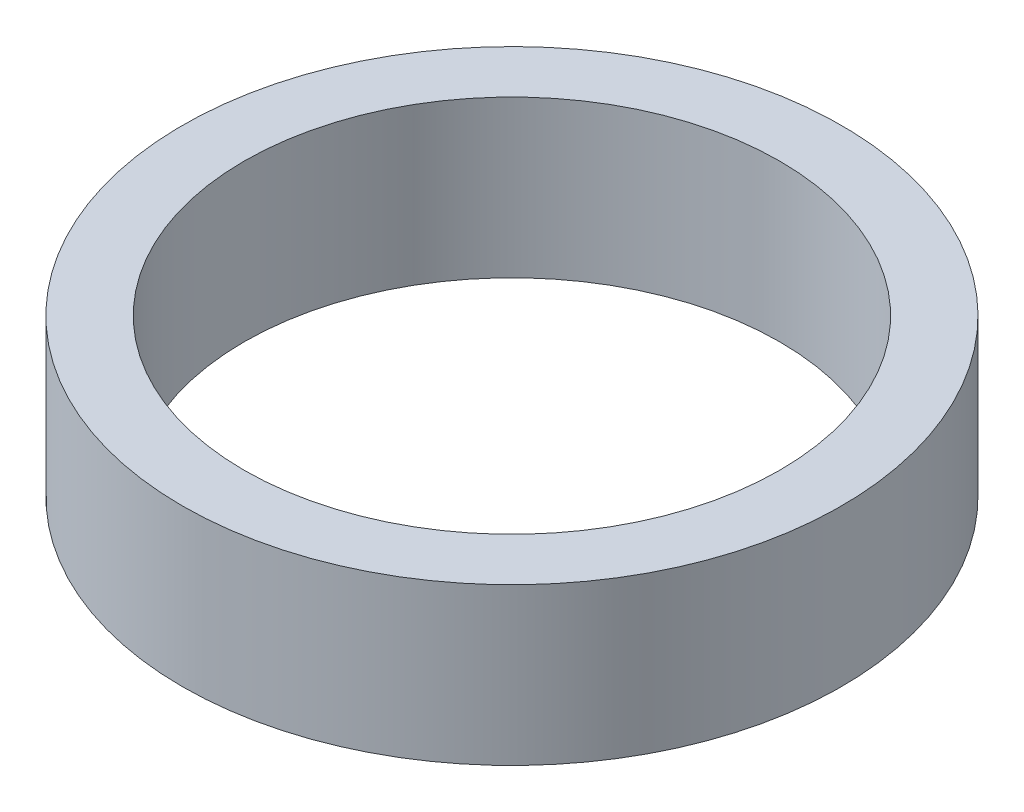
ISO-10303-21;
HEADER;
FILE_DESCRIPTION(('STEP AP214'),'2;1');
FILE_NAME('part.step','',(''),(''),'','','');
FILE_SCHEMA(('AUTOMOTIVE_DESIGN { 1 0 10303 214 1 1 1 1 }'));
ENDSEC;
DATA;
#1=APPLICATION_CONTEXT('core data for automotive mechanical design processes');
#2=APPLICATION_PROTOCOL_DEFINITION('international standard','automotive_design',2000,#1);
#3=PRODUCT_CONTEXT('',#1,'mechanical');
#4=PRODUCT('Part','Part','',(#3));
#5=PRODUCT_RELATED_PRODUCT_CATEGORY('part','',(#4));
#6=PRODUCT_DEFINITION_FORMATION('','',#4);
#7=PRODUCT_DEFINITION_CONTEXT('part definition',#1,'design');
#8=PRODUCT_DEFINITION('design','',#6,#7);
#9=PRODUCT_DEFINITION_SHAPE('','',#8);
#10=(LENGTH_UNIT() NAMED_UNIT(*) SI_UNIT(.MILLI.,.METRE.));
#11=(NAMED_UNIT(*) PLANE_ANGLE_UNIT() SI_UNIT($,.RADIAN.));
#12=(NAMED_UNIT(*) SI_UNIT($,.STERADIAN.) SOLID_ANGLE_UNIT());
#13=UNCERTAINTY_MEASURE_WITH_UNIT(LENGTH_MEASURE(1.E-05),#10,'distance_accuracy_value','');
#14=(GEOMETRIC_REPRESENTATION_CONTEXT(3) GLOBAL_UNCERTAINTY_ASSIGNED_CONTEXT((#13)) GLOBAL_UNIT_ASSIGNED_CONTEXT((#10,
#11,#12)) REPRESENTATION_CONTEXT('',''));
#15=CARTESIAN_POINT('',(0.,0.,0.));
#16=DIRECTION('',(0.,0.,1.));
#17=DIRECTION('',(1.,0.,0.));
#18=AXIS2_PLACEMENT_3D('',#15,#16,#17);
#19=CARTESIAN_POINT('',(0.,19.,0.));
#20=DIRECTION('',(0.,-1.,0.));
#21=DIRECTION('',(0.,0.,-1.));
#22=AXIS2_PLACEMENT_3D('',#19,#20,#21);
#23=CYLINDRICAL_SURFACE('',#22,40.);
#24=CARTESIAN_POINT('',(0.,19.,0.));
#25=DIRECTION('',(0.,1.,0.));
#26=DIRECTION('',(0.,0.,1.));
#27=AXIS2_PLACEMENT_3D('',#24,#25,#26);
#28=CIRCLE('',#27,40.);
#29=CARTESIAN_POINT('',(0.,19.,40.));
#30=VERTEX_POINT('',#29);
#31=EDGE_CURVE('E10',#30,#30,#28,.T.);
#32=ORIENTED_EDGE('',*,*,#31,.F.);
#33=EDGE_LOOP('',(#32));
#34=FACE_BOUND('',#33,.T.);
#35=CARTESIAN_POINT('',(0.,0.,0.));
#36=DIRECTION('',(0.,1.,0.));
#37=DIRECTION('',(0.,0.,1.));
#38=AXIS2_PLACEMENT_3D('',#35,#36,#37);
#39=CIRCLE('',#38,40.);
#40=CARTESIAN_POINT('',(0.,0.,40.));
#41=VERTEX_POINT('',#40);
#42=EDGE_CURVE('E37',#41,#41,#39,.T.);
#43=ORIENTED_EDGE('',*,*,#42,.T.);
#44=EDGE_LOOP('',(#43));
#45=FACE_BOUND('',#44,.T.);
#46=ADVANCED_FACE('F40',(#34,#45),#23,.T.);
#47=CARTESIAN_POINT('',(0.,19.,0.));
#48=DIRECTION('',(0.,1.,0.));
#49=DIRECTION('',(0.,0.,1.));
#50=AXIS2_PLACEMENT_3D('',#47,#48,#49);
#51=PLANE('',#50);
#52=CARTESIAN_POINT('',(0.,19.,0.));
#53=DIRECTION('',(0.,1.,0.));
#54=DIRECTION('',(0.,0.,1.));
#55=AXIS2_PLACEMENT_3D('',#52,#53,#54);
#56=CIRCLE('',#55,32.5);
#57=CARTESIAN_POINT('',(0.,19.,32.5));
#58=VERTEX_POINT('',#57);
#59=EDGE_CURVE('E50',#58,#58,#56,.T.);
#60=ORIENTED_EDGE('',*,*,#59,.F.);
#61=EDGE_LOOP('',(#60));
#62=FACE_BOUND('',#61,.T.);
#63=ORIENTED_EDGE('',*,*,#31,.T.);
#64=EDGE_LOOP('',(#63));
#65=FACE_BOUND('',#64,.T.);
#66=ADVANCED_FACE('F59',(#62,#65),#51,.T.);
#67=CARTESIAN_POINT('',(0.,0.,0.));
#68=DIRECTION('',(0.,1.,0.));
#69=DIRECTION('',(0.,0.,1.));
#70=AXIS2_PLACEMENT_3D('',#67,#68,#69);
#71=PLANE('',#70);
#72=CARTESIAN_POINT('',(0.,0.,0.));
#73=DIRECTION('',(0.,1.,0.));
#74=DIRECTION('',(0.,0.,1.));
#75=AXIS2_PLACEMENT_3D('',#72,#73,#74);
#76=CIRCLE('',#75,32.5);
#77=CARTESIAN_POINT('',(0.,0.,32.5));
#78=VERTEX_POINT('',#77);
#79=EDGE_CURVE('E47',#78,#78,#76,.T.);
#80=ORIENTED_EDGE('',*,*,#79,.T.);
#81=EDGE_LOOP('',(#80));
#82=FACE_BOUND('',#81,.T.);
#83=ORIENTED_EDGE('',*,*,#42,.F.);
#84=EDGE_LOOP('',(#83));
#85=FACE_BOUND('',#84,.T.);
#86=ADVANCED_FACE('F58',(#82,#85),#71,.F.);
#87=CARTESIAN_POINT('',(0.,19.,0.));
#88=DIRECTION('',(0.,-1.,0.));
#89=DIRECTION('',(0.,0.,-1.));
#90=AXIS2_PLACEMENT_3D('',#87,#88,#89);
#91=CYLINDRICAL_SURFACE('',#90,32.5);
#92=ORIENTED_EDGE('',*,*,#59,.T.);
#93=EDGE_LOOP('',(#92));
#94=FACE_BOUND('',#93,.T.);
#95=ORIENTED_EDGE('',*,*,#79,.F.);
#96=EDGE_LOOP('',(#95));
#97=FACE_BOUND('',#96,.T.);
#98=ADVANCED_FACE('F54',(#94,#97),#91,.F.);
#99=CLOSED_SHELL('',(#46,#66,#86,#98));
#100=MANIFOLD_SOLID_BREP('B2',#99);
#101=ADVANCED_BREP_SHAPE_REPRESENTATION('',(#18,#100),#14);
#102=SHAPE_DEFINITION_REPRESENTATION(#9,#101);
ENDSEC;
END-ISO-10303-21;
